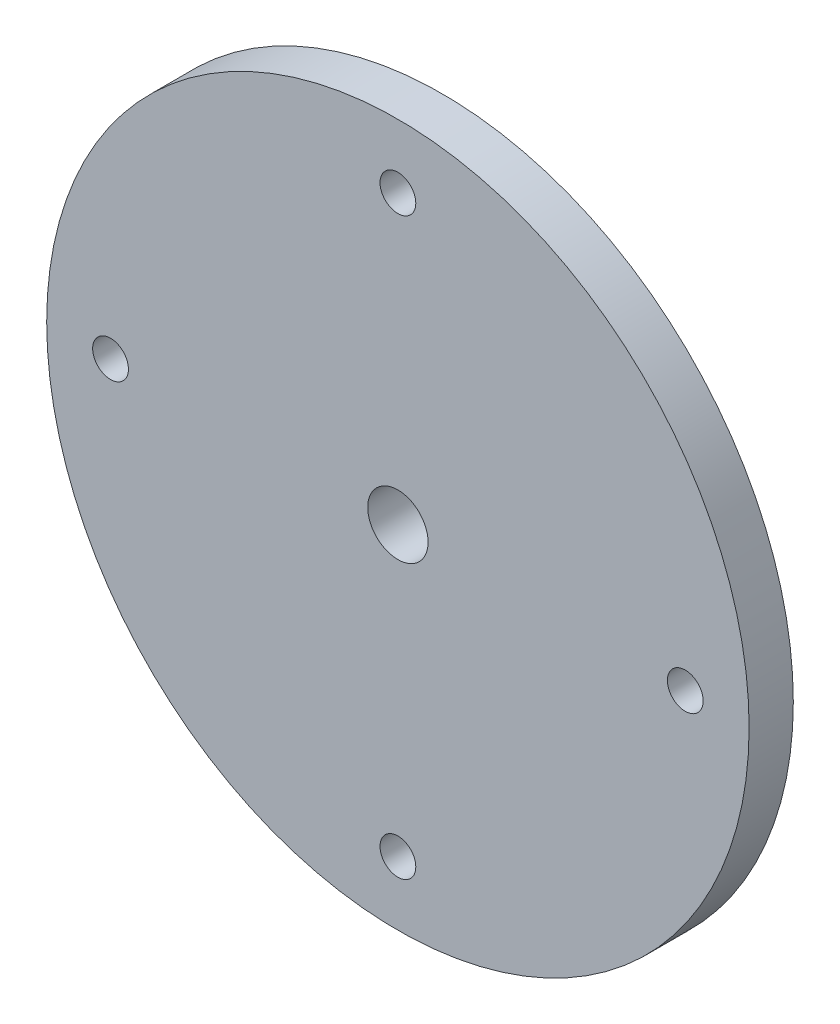
ISO-10303-21;
HEADER;
FILE_DESCRIPTION(('STEP AP214'),'2;1');
FILE_NAME('part.step','',(''),(''),'','','');
FILE_SCHEMA(('AUTOMOTIVE_DESIGN { 1 0 10303 214 1 1 1 1 }'));
ENDSEC;
DATA;
#1=APPLICATION_CONTEXT('core data for automotive mechanical design processes');
#2=APPLICATION_PROTOCOL_DEFINITION('international standard','automotive_design',2000,#1);
#3=PRODUCT_CONTEXT('',#1,'mechanical');
#4=PRODUCT('Part','Part','',(#3));
#5=PRODUCT_RELATED_PRODUCT_CATEGORY('part','',(#4));
#6=PRODUCT_DEFINITION_FORMATION('','',#4);
#7=PRODUCT_DEFINITION_CONTEXT('part definition',#1,'design');
#8=PRODUCT_DEFINITION('design','',#6,#7);
#9=PRODUCT_DEFINITION_SHAPE('','',#8);
#10=(LENGTH_UNIT() NAMED_UNIT(*) SI_UNIT(.MILLI.,.METRE.));
#11=(NAMED_UNIT(*) PLANE_ANGLE_UNIT() SI_UNIT($,.RADIAN.));
#12=(NAMED_UNIT(*) SI_UNIT($,.STERADIAN.) SOLID_ANGLE_UNIT());
#13=UNCERTAINTY_MEASURE_WITH_UNIT(LENGTH_MEASURE(1.E-05),#10,'distance_accuracy_value','');
#14=(GEOMETRIC_REPRESENTATION_CONTEXT(3) GLOBAL_UNCERTAINTY_ASSIGNED_CONTEXT((#13)) GLOBAL_UNIT_ASSIGNED_CONTEXT((#10,
#11,#12)) REPRESENTATION_CONTEXT('',''));
#15=CARTESIAN_POINT('',(0.,0.,0.));
#16=DIRECTION('',(0.,0.,1.));
#17=DIRECTION('',(1.,0.,0.));
#18=AXIS2_PLACEMENT_3D('',#15,#16,#17);
#19=CARTESIAN_POINT('',(0.,0.,4.3942));
#20=DIRECTION('',(0.,0.,1.));
#21=DIRECTION('',(1.,0.,0.));
#22=AXIS2_PLACEMENT_3D('',#19,#20,#21);
#23=PLANE('',#22);
#24=CARTESIAN_POINT('',(0.,-28.575,4.3942));
#25=DIRECTION('',(0.,0.,1.));
#26=DIRECTION('',(1.,0.,0.));
#27=AXIS2_PLACEMENT_3D('',#24,#25,#26);
#28=CIRCLE('',#27,1.778);
#29=CARTESIAN_POINT('',(1.778,-28.575,4.3942));
#30=VERTEX_POINT('',#29);
#31=EDGE_CURVE('E59',#30,#30,#28,.T.);
#32=ORIENTED_EDGE('',*,*,#31,.F.);
#33=EDGE_LOOP('',(#32));
#34=FACE_BOUND('',#33,.T.);
#35=CARTESIAN_POINT('',(0.,28.575,4.3942));
#36=DIRECTION('',(0.,0.,1.));
#37=DIRECTION('',(1.,0.,0.));
#38=AXIS2_PLACEMENT_3D('',#35,#36,#37);
#39=CIRCLE('',#38,1.778);
#40=CARTESIAN_POINT('',(1.778,28.575,4.3942));
#41=VERTEX_POINT('',#40);
#42=EDGE_CURVE('E47',#41,#41,#39,.T.);
#43=ORIENTED_EDGE('',*,*,#42,.F.);
#44=EDGE_LOOP('',(#43));
#45=FACE_BOUND('',#44,.T.);
#46=CARTESIAN_POINT('',(0.,0.,4.3942));
#47=DIRECTION('',(0.,0.,1.));
#48=DIRECTION('',(1.,0.,0.));
#49=AXIS2_PLACEMENT_3D('',#46,#47,#48);
#50=CIRCLE('',#49,34.925);
#51=CARTESIAN_POINT('',(34.925,0.,4.3942));
#52=VERTEX_POINT('',#51);
#53=EDGE_CURVE('E10',#52,#52,#50,.T.);
#54=ORIENTED_EDGE('',*,*,#53,.T.);
#55=EDGE_LOOP('',(#54));
#56=FACE_BOUND('',#55,.T.);
#57=CARTESIAN_POINT('',(0.,0.,4.3942));
#58=DIRECTION('',(0.,0.,1.));
#59=DIRECTION('',(1.,0.,0.));
#60=AXIS2_PLACEMENT_3D('',#57,#58,#59);
#61=CIRCLE('',#60,3.);
#62=CARTESIAN_POINT('',(3.,0.,4.3942));
#63=VERTEX_POINT('',#62);
#64=EDGE_CURVE('E42',#63,#63,#61,.T.);
#65=ORIENTED_EDGE('',*,*,#64,.F.);
#66=EDGE_LOOP('',(#65));
#67=FACE_BOUND('',#66,.T.);
#68=CARTESIAN_POINT('',(28.575,0.,4.3942));
#69=DIRECTION('',(0.,0.,1.));
#70=DIRECTION('',(1.,0.,0.));
#71=AXIS2_PLACEMENT_3D('',#68,#69,#70);
#72=CIRCLE('',#71,1.778);
#73=CARTESIAN_POINT('',(30.353,0.,4.3942));
#74=VERTEX_POINT('',#73);
#75=EDGE_CURVE('E53',#74,#74,#72,.T.);
#76=ORIENTED_EDGE('',*,*,#75,.F.);
#77=EDGE_LOOP('',(#76));
#78=FACE_BOUND('',#77,.T.);
#79=CARTESIAN_POINT('',(-28.575,0.,4.3942));
#80=DIRECTION('',(0.,0.,1.));
#81=DIRECTION('',(1.,0.,0.));
#82=AXIS2_PLACEMENT_3D('',#79,#80,#81);
#83=CIRCLE('',#82,1.77800000000001);
#84=CARTESIAN_POINT('',(-26.797,0.,4.3942));
#85=VERTEX_POINT('',#84);
#86=EDGE_CURVE('E65',#85,#85,#83,.T.);
#87=ORIENTED_EDGE('',*,*,#86,.F.);
#88=EDGE_LOOP('',(#87));
#89=FACE_BOUND('',#88,.T.);
#90=ADVANCED_FACE('F31',(#34,#45,#56,#67,#78,#89),#23,.T.);
#91=CARTESIAN_POINT('',(0.,0.,0.));
#92=DIRECTION('',(0.,0.,1.));
#93=DIRECTION('',(1.,0.,0.));
#94=AXIS2_PLACEMENT_3D('',#91,#92,#93);
#95=PLANE('',#94);
#96=CARTESIAN_POINT('',(0.,-28.575,0.));
#97=DIRECTION('',(0.,0.,1.));
#98=DIRECTION('',(1.,0.,0.));
#99=AXIS2_PLACEMENT_3D('',#96,#97,#98);
#100=CIRCLE('',#99,1.778);
#101=CARTESIAN_POINT('',(1.778,-28.575,0.));
#102=VERTEX_POINT('',#101);
#103=EDGE_CURVE('E62',#102,#102,#100,.T.);
#104=ORIENTED_EDGE('',*,*,#103,.T.);
#105=EDGE_LOOP('',(#104));
#106=FACE_BOUND('',#105,.T.);
#107=CARTESIAN_POINT('',(0.,28.575,0.));
#108=DIRECTION('',(0.,0.,1.));
#109=DIRECTION('',(1.,0.,0.));
#110=AXIS2_PLACEMENT_3D('',#107,#108,#109);
#111=CIRCLE('',#110,1.778);
#112=CARTESIAN_POINT('',(1.778,28.575,0.));
#113=VERTEX_POINT('',#112);
#114=EDGE_CURVE('E50',#113,#113,#111,.T.);
#115=ORIENTED_EDGE('',*,*,#114,.T.);
#116=EDGE_LOOP('',(#115));
#117=FACE_BOUND('',#116,.T.);
#118=CARTESIAN_POINT('',(0.,0.,0.));
#119=DIRECTION('',(0.,0.,1.));
#120=DIRECTION('',(1.,0.,0.));
#121=AXIS2_PLACEMENT_3D('',#118,#119,#120);
#122=CIRCLE('',#121,34.925);
#123=CARTESIAN_POINT('',(34.925,0.,0.));
#124=VERTEX_POINT('',#123);
#125=EDGE_CURVE('E35',#124,#124,#122,.T.);
#126=ORIENTED_EDGE('',*,*,#125,.F.);
#127=EDGE_LOOP('',(#126));
#128=FACE_BOUND('',#127,.T.);
#129=CARTESIAN_POINT('',(0.,0.,0.));
#130=DIRECTION('',(0.,0.,1.));
#131=DIRECTION('',(1.,0.,0.));
#132=AXIS2_PLACEMENT_3D('',#129,#130,#131);
#133=CIRCLE('',#132,3.);
#134=CARTESIAN_POINT('',(3.,0.,0.));
#135=VERTEX_POINT('',#134);
#136=EDGE_CURVE('E44',#135,#135,#133,.T.);
#137=ORIENTED_EDGE('',*,*,#136,.T.);
#138=EDGE_LOOP('',(#137));
#139=FACE_BOUND('',#138,.T.);
#140=CARTESIAN_POINT('',(28.575,0.,0.));
#141=DIRECTION('',(0.,0.,1.));
#142=DIRECTION('',(1.,0.,0.));
#143=AXIS2_PLACEMENT_3D('',#140,#141,#142);
#144=CIRCLE('',#143,1.778);
#145=CARTESIAN_POINT('',(30.353,0.,0.));
#146=VERTEX_POINT('',#145);
#147=EDGE_CURVE('E56',#146,#146,#144,.T.);
#148=ORIENTED_EDGE('',*,*,#147,.T.);
#149=EDGE_LOOP('',(#148));
#150=FACE_BOUND('',#149,.T.);
#151=CARTESIAN_POINT('',(-28.575,0.,0.));
#152=DIRECTION('',(0.,0.,1.));
#153=DIRECTION('',(1.,0.,0.));
#154=AXIS2_PLACEMENT_3D('',#151,#152,#153);
#155=CIRCLE('',#154,1.77800000000001);
#156=CARTESIAN_POINT('',(-26.797,0.,0.));
#157=VERTEX_POINT('',#156);
#158=EDGE_CURVE('E68',#157,#157,#155,.T.);
#159=ORIENTED_EDGE('',*,*,#158,.T.);
#160=EDGE_LOOP('',(#159));
#161=FACE_BOUND('',#160,.T.);
#162=ADVANCED_FACE('F78',(#106,#117,#128,#139,#150,#161),#95,.F.);
#163=CARTESIAN_POINT('',(0.,0.,4.3942));
#164=DIRECTION('',(0.,0.,-1.));
#165=DIRECTION('',(-1.,0.,0.));
#166=AXIS2_PLACEMENT_3D('',#163,#164,#165);
#167=CYLINDRICAL_SURFACE('',#166,34.925);
#168=ORIENTED_EDGE('',*,*,#53,.F.);
#169=EDGE_LOOP('',(#168));
#170=FACE_BOUND('',#169,.T.);
#171=ORIENTED_EDGE('',*,*,#125,.T.);
#172=EDGE_LOOP('',(#171));
#173=FACE_BOUND('',#172,.T.);
#174=ADVANCED_FACE('F33',(#170,#173),#167,.T.);
#175=CARTESIAN_POINT('',(0.,0.,4.3942));
#176=DIRECTION('',(0.,0.,-1.));
#177=DIRECTION('',(-1.,0.,0.));
#178=AXIS2_PLACEMENT_3D('',#175,#176,#177);
#179=CYLINDRICAL_SURFACE('',#178,3.);
#180=ORIENTED_EDGE('',*,*,#64,.T.);
#181=EDGE_LOOP('',(#180));
#182=FACE_BOUND('',#181,.T.);
#183=ORIENTED_EDGE('',*,*,#136,.F.);
#184=EDGE_LOOP('',(#183));
#185=FACE_BOUND('',#184,.T.);
#186=ADVANCED_FACE('F88',(#182,#185),#179,.F.);
#187=CARTESIAN_POINT('',(0.,28.575,4.3942));
#188=DIRECTION('',(0.,0.,-1.));
#189=DIRECTION('',(-1.,0.,0.));
#190=AXIS2_PLACEMENT_3D('',#187,#188,#189);
#191=CYLINDRICAL_SURFACE('',#190,1.778);
#192=ORIENTED_EDGE('',*,*,#42,.T.);
#193=EDGE_LOOP('',(#192));
#194=FACE_BOUND('',#193,.T.);
#195=ORIENTED_EDGE('',*,*,#114,.F.);
#196=EDGE_LOOP('',(#195));
#197=FACE_BOUND('',#196,.T.);
#198=ADVANCED_FACE('F91',(#194,#197),#191,.F.);
#199=CARTESIAN_POINT('',(28.575,0.,4.3942));
#200=DIRECTION('',(0.,0.,-1.));
#201=DIRECTION('',(-1.,0.,0.));
#202=AXIS2_PLACEMENT_3D('',#199,#200,#201);
#203=CYLINDRICAL_SURFACE('',#202,1.778);
#204=ORIENTED_EDGE('',*,*,#75,.T.);
#205=EDGE_LOOP('',(#204));
#206=FACE_BOUND('',#205,.T.);
#207=ORIENTED_EDGE('',*,*,#147,.F.);
#208=EDGE_LOOP('',(#207));
#209=FACE_BOUND('',#208,.T.);
#210=ADVANCED_FACE('F95',(#206,#209),#203,.F.);
#211=CARTESIAN_POINT('',(0.,-28.575,4.3942));
#212=DIRECTION('',(0.,0.,-1.));
#213=DIRECTION('',(-1.,0.,0.));
#214=AXIS2_PLACEMENT_3D('',#211,#212,#213);
#215=CYLINDRICAL_SURFACE('',#214,1.778);
#216=ORIENTED_EDGE('',*,*,#31,.T.);
#217=EDGE_LOOP('',(#216));
#218=FACE_BOUND('',#217,.T.);
#219=ORIENTED_EDGE('',*,*,#103,.F.);
#220=EDGE_LOOP('',(#219));
#221=FACE_BOUND('',#220,.T.);
#222=ADVANCED_FACE('F99',(#218,#221),#215,.F.);
#223=CARTESIAN_POINT('',(-28.575,0.,4.3942));
#224=DIRECTION('',(0.,0.,-1.));
#225=DIRECTION('',(-1.,0.,0.));
#226=AXIS2_PLACEMENT_3D('',#223,#224,#225);
#227=CYLINDRICAL_SURFACE('',#226,1.77800000000001);
#228=ORIENTED_EDGE('',*,*,#86,.T.);
#229=EDGE_LOOP('',(#228));
#230=FACE_BOUND('',#229,.T.);
#231=ORIENTED_EDGE('',*,*,#158,.F.);
#232=EDGE_LOOP('',(#231));
#233=FACE_BOUND('',#232,.T.);
#234=ADVANCED_FACE('F74',(#230,#233),#227,.F.);
#235=CLOSED_SHELL('',(#90,#162,#174,#186,#198,#210,#222,#234));
#236=MANIFOLD_SOLID_BREP('B2',#235);
#237=ADVANCED_BREP_SHAPE_REPRESENTATION('',(#18,#236),#14);
#238=SHAPE_DEFINITION_REPRESENTATION(#9,#237);
ENDSEC;
END-ISO-10303-21;
